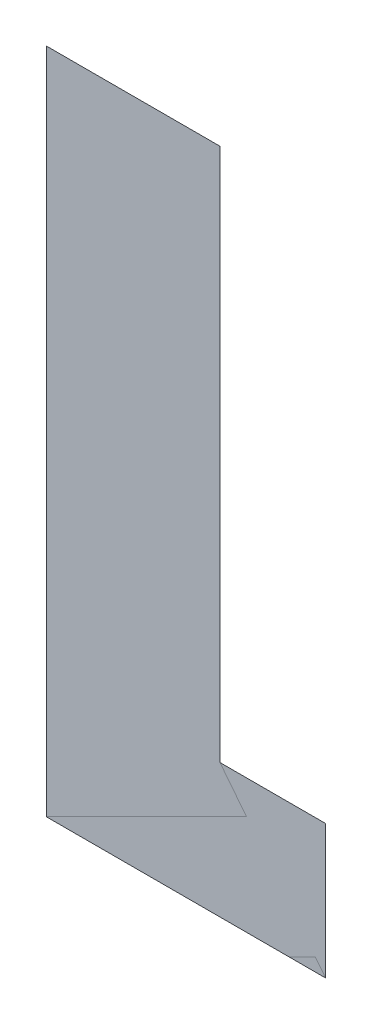
ISO-10303-21;
HEADER;
FILE_DESCRIPTION(('STEP AP214'),'2;1');
FILE_NAME('part.step','',(''),(''),'','','');
FILE_SCHEMA(('AUTOMOTIVE_DESIGN { 1 0 10303 214 1 1 1 1 }'));
ENDSEC;
DATA;
#1=APPLICATION_CONTEXT('core data for automotive mechanical design processes');
#2=APPLICATION_PROTOCOL_DEFINITION('international standard','automotive_design',2000,#1);
#3=PRODUCT_CONTEXT('',#1,'mechanical');
#4=PRODUCT('Part','Part','',(#3));
#5=PRODUCT_RELATED_PRODUCT_CATEGORY('part','',(#4));
#6=PRODUCT_DEFINITION_FORMATION('','',#4);
#7=PRODUCT_DEFINITION_CONTEXT('part definition',#1,'design');
#8=PRODUCT_DEFINITION('design','',#6,#7);
#9=PRODUCT_DEFINITION_SHAPE('','',#8);
#10=(LENGTH_UNIT() NAMED_UNIT(*) SI_UNIT(.MILLI.,.METRE.));
#11=(NAMED_UNIT(*) PLANE_ANGLE_UNIT() SI_UNIT($,.RADIAN.));
#12=(NAMED_UNIT(*) SI_UNIT($,.STERADIAN.) SOLID_ANGLE_UNIT());
#13=UNCERTAINTY_MEASURE_WITH_UNIT(LENGTH_MEASURE(1.E-05),#10,'distance_accuracy_value','');
#14=(GEOMETRIC_REPRESENTATION_CONTEXT(3) GLOBAL_UNCERTAINTY_ASSIGNED_CONTEXT((#13)) GLOBAL_UNIT_ASSIGNED_CONTEXT((#10,
#11,#12)) REPRESENTATION_CONTEXT('',''));
#15=CARTESIAN_POINT('',(0.,0.,0.));
#16=DIRECTION('',(0.,0.,1.));
#17=DIRECTION('',(1.,0.,0.));
#18=AXIS2_PLACEMENT_3D('',#15,#16,#17);
#19=CARTESIAN_POINT('',(6.013853818617,0.791864073717,0.001668));
#20=DIRECTION('',(0.,0.,1.));
#21=DIRECTION('',(1.,0.,0.));
#22=AXIS2_PLACEMENT_3D('',#19,#20,#21);
#23=PLANE('',#22);
#24=CARTESIAN_POINT('',(6.070688545304,0.689856296154,0.001668));
#25=DIRECTION('',(0.,1.,0.));
#26=VECTOR('',#25,1.);
#27=LINE('',#24,#26);
#28=CARTESIAN_POINT('',(6.070688545304,0.689856296154,0.0015));
#29=VERTEX_POINT('',#28);
#30=CARTESIAN_POINT('',(6.070688545304,0.734757577908,0.0015));
#31=VERTEX_POINT('',#30);
#32=EDGE_CURVE('E116',#29,#31,#27,.T.);
#33=ORIENTED_EDGE('',*,*,#32,.T.);
#34=CARTESIAN_POINT('',(6.070688545304,0.734757577908,0.001668));
#35=DIRECTION('',(-1.,0.,0.));
#36=VECTOR('',#35,1.);
#37=LINE('',#34,#36);
#38=CARTESIAN_POINT('',(6.035240164972,0.734757577908,0.0015));
#39=VERTEX_POINT('',#38);
#40=EDGE_CURVE('E28',#31,#39,#37,.T.);
#41=ORIENTED_EDGE('',*,*,#40,.T.);
#42=CARTESIAN_POINT('',(6.035240164972,0.734757577908,0.001668));
#43=DIRECTION('',(0.,1.,0.));
#44=VECTOR('',#43,1.);
#45=LINE('',#42,#44);
#46=CARTESIAN_POINT('',(6.035240164972,0.913856299492,0.0015));
#47=VERTEX_POINT('',#46);
#48=EDGE_CURVE('E11',#39,#47,#45,.T.);
#49=ORIENTED_EDGE('',*,*,#48,.T.);
#50=CARTESIAN_POINT('',(6.035240164972,0.913856299492,0.001668));
#51=DIRECTION('',(-1.,0.,0.));
#52=VECTOR('',#51,1.);
#53=LINE('',#50,#52);
#54=CARTESIAN_POINT('',(5.97700354014,0.913856299492,0.0015));
#55=VERTEX_POINT('',#54);
#56=EDGE_CURVE('E50',#47,#55,#53,.T.);
#57=ORIENTED_EDGE('',*,*,#56,.T.);
#58=CARTESIAN_POINT('',(5.97700354014,0.913856299492,0.001668));
#59=DIRECTION('',(0.,-1.,0.));
#60=VECTOR('',#59,1.);
#61=LINE('',#58,#60);
#62=CARTESIAN_POINT('',(5.97700354014,0.689856296154,0.0015));
#63=VERTEX_POINT('',#62);
#64=EDGE_CURVE('E47',#55,#63,#61,.T.);
#65=ORIENTED_EDGE('',*,*,#64,.T.);
#66=CARTESIAN_POINT('',(5.97700354014,0.689856296154,0.001668));
#67=DIRECTION('',(1.,0.,0.));
#68=VECTOR('',#67,1.);
#69=LINE('',#66,#68);
#70=EDGE_CURVE('E115',#63,#29,#69,.T.);
#71=ORIENTED_EDGE('',*,*,#70,.T.);
#72=EDGE_LOOP('',(#33,#41,#49,#57,#65,#71));
#73=FACE_BOUND('',#72,.T.);
#74=ADVANCED_FACE('F17',(#73),#23,.T.);
#75=CARTESIAN_POINT('',(6.013853818617,0.791864073717,0.001332));
#76=DIRECTION('',(0.,0.,1.));
#77=DIRECTION('',(1.,0.,0.));
#78=AXIS2_PLACEMENT_3D('',#75,#76,#77);
#79=PLANE('',#78);
#80=ORIENTED_EDGE('',*,*,#40,.F.);
#81=ORIENTED_EDGE('',*,*,#32,.F.);
#82=ORIENTED_EDGE('',*,*,#70,.F.);
#83=ORIENTED_EDGE('',*,*,#64,.F.);
#84=ORIENTED_EDGE('',*,*,#56,.F.);
#85=ORIENTED_EDGE('',*,*,#48,.F.);
#86=EDGE_LOOP('',(#80,#81,#82,#83,#84,#85));
#87=FACE_BOUND('',#86,.T.);
#88=ADVANCED_FACE('F52',(#87),#79,.F.);
#89=CLOSED_SHELL('',(#74,#88));
#90=MANIFOLD_SOLID_BREP('B1',#89);
#91=ADVANCED_BREP_SHAPE_REPRESENTATION('',(#18,#90),#14);
#92=SHAPE_DEFINITION_REPRESENTATION(#9,#91);
ENDSEC;
END-ISO-10303-21;
